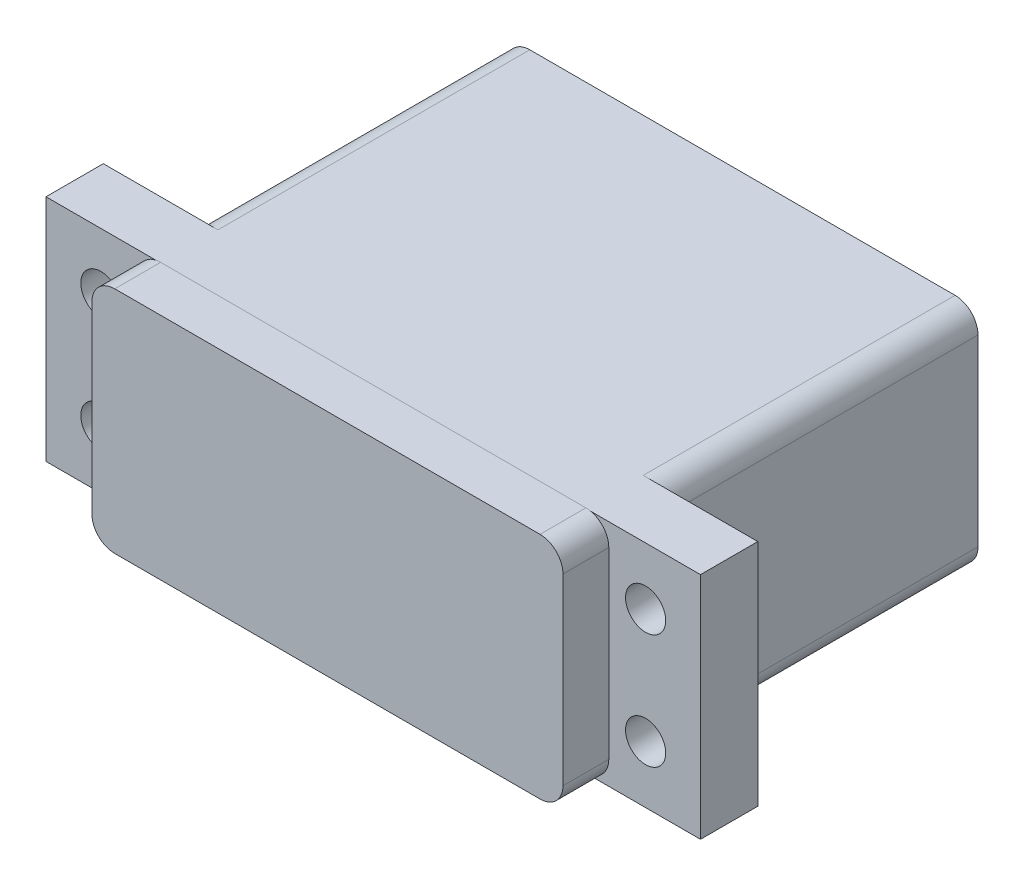
ISO-10303-21;
HEADER;
FILE_DESCRIPTION(('STEP AP214'),'2;1');
FILE_NAME('part.step','',(''),(''),'','','');
FILE_SCHEMA(('AUTOMOTIVE_DESIGN { 1 0 10303 214 1 1 1 1 }'));
ENDSEC;
DATA;
#1=APPLICATION_CONTEXT('core data for automotive mechanical design processes');
#2=APPLICATION_PROTOCOL_DEFINITION('international standard','automotive_design',2000,#1);
#3=PRODUCT_CONTEXT('',#1,'mechanical');
#4=PRODUCT('Part','Part','',(#3));
#5=PRODUCT_RELATED_PRODUCT_CATEGORY('part','',(#4));
#6=PRODUCT_DEFINITION_FORMATION('','',#4);
#7=PRODUCT_DEFINITION_CONTEXT('part definition',#1,'design');
#8=PRODUCT_DEFINITION('design','',#6,#7);
#9=PRODUCT_DEFINITION_SHAPE('','',#8);
#10=(LENGTH_UNIT() NAMED_UNIT(*) SI_UNIT(.MILLI.,.METRE.));
#11=(NAMED_UNIT(*) PLANE_ANGLE_UNIT() SI_UNIT($,.RADIAN.));
#12=(NAMED_UNIT(*) SI_UNIT($,.STERADIAN.) SOLID_ANGLE_UNIT());
#13=UNCERTAINTY_MEASURE_WITH_UNIT(LENGTH_MEASURE(1.E-05),#10,'distance_accuracy_value','');
#14=(GEOMETRIC_REPRESENTATION_CONTEXT(3) GLOBAL_UNCERTAINTY_ASSIGNED_CONTEXT((#13)) GLOBAL_UNIT_ASSIGNED_CONTEXT((#10,
#11,#12)) REPRESENTATION_CONTEXT('',''));
#15=CARTESIAN_POINT('',(0.,0.,0.));
#16=DIRECTION('',(0.,0.,1.));
#17=DIRECTION('',(1.,0.,0.));
#18=AXIS2_PLACEMENT_3D('',#15,#16,#17);
#19=CARTESIAN_POINT('',(0.,0.,32.21));
#20=DIRECTION('',(0.,0.,-1.));
#21=DIRECTION('',(-1.,0.,0.));
#22=AXIS2_PLACEMENT_3D('',#19,#20,#21);
#23=PLANE('',#22);
#24=CARTESIAN_POINT('',(52.2578901184198,-10.324573125464,32.21));
#25=DIRECTION('',(0.,0.,1.));
#26=DIRECTION('',(-1.,0.,0.));
#27=AXIS2_PLACEMENT_3D('',#24,#25,#26);
#28=CIRCLE('',#27,1.75259649145021);
#29=CARTESIAN_POINT('',(50.5052936269696,-10.324573125464,32.21));
#30=VERTEX_POINT('',#29);
#31=EDGE_CURVE('E359',#30,#30,#28,.T.);
#32=ORIENTED_EDGE('',*,*,#31,.F.);
#33=EDGE_LOOP('',(#32));
#34=FACE_BOUND('',#33,.T.);
#35=CARTESIAN_POINT('',(52.2578901184198,-20.324573125464,32.21));
#36=DIRECTION('',(0.,0.,1.));
#37=DIRECTION('',(1.,0.,0.));
#38=AXIS2_PLACEMENT_3D('',#35,#36,#37);
#39=CIRCLE('',#38,1.75259649145021);
#40=CARTESIAN_POINT('',(54.01048660987,-20.324573125464,32.21));
#41=VERTEX_POINT('',#40);
#42=EDGE_CURVE('E349',#41,#41,#39,.T.);
#43=ORIENTED_EDGE('',*,*,#42,.F.);
#44=EDGE_LOOP('',(#43));
#45=FACE_BOUND('',#44,.T.);
#46=CARTESIAN_POINT('',(4.73476021565602,-20.324573125464,32.21));
#47=DIRECTION('',(0.,0.,1.));
#48=DIRECTION('',(-1.,0.,0.));
#49=AXIS2_PLACEMENT_3D('',#46,#47,#48);
#50=CIRCLE('',#49,1.75259649145021);
#51=CARTESIAN_POINT('',(2.98216372420581,-20.324573125464,32.21));
#52=VERTEX_POINT('',#51);
#53=EDGE_CURVE('E346',#52,#52,#50,.T.);
#54=ORIENTED_EDGE('',*,*,#53,.F.);
#55=EDGE_LOOP('',(#54));
#56=FACE_BOUND('',#55,.T.);
#57=CARTESIAN_POINT('',(4.73476021565602,-10.324573125464,32.21));
#58=DIRECTION('',(0.,0.,1.));
#59=DIRECTION('',(1.,0.,0.));
#60=AXIS2_PLACEMENT_3D('',#57,#58,#59);
#61=CIRCLE('',#60,1.75259649145021);
#62=CARTESIAN_POINT('',(6.48735670710623,-10.324573125464,32.21));
#63=VERTEX_POINT('',#62);
#64=EDGE_CURVE('E343',#63,#63,#61,.T.);
#65=ORIENTED_EDGE('',*,*,#64,.F.);
#66=EDGE_LOOP('',(#65));
#67=FACE_BOUND('',#66,.T.);
#68=CARTESIAN_POINT('',(9.94632516703789,-7.27930100560158,32.21));
#69=DIRECTION('',(0.,0.,1.));
#70=DIRECTION('',(-1.,0.,0.));
#71=AXIS2_PLACEMENT_3D('',#68,#69,#70);
#72=CIRCLE('',#71,2.);
#73=CARTESIAN_POINT('',(9.52319526427415,-5.324573125464,32.21));
#74=VERTEX_POINT('',#73);
#75=CARTESIAN_POINT('',(7.94632516703789,-7.27930100560158,32.21));
#76=VERTEX_POINT('',#75);
#77=EDGE_CURVE('E11',#74,#76,#72,.T.);
#78=ORIENTED_EDGE('',*,*,#77,.F.);
#79=DIRECTION('',(-1.,0.,0.));
#80=VECTOR('',#79,1.);
#81=CARTESIAN_POINT('',(-0.0536748329621126,-5.324573125464,32.21));
#82=LINE('',#81,#80);
#83=CARTESIAN_POINT('',(-0.0536748329621126,-5.324573125464,32.21));
#84=VERTEX_POINT('',#83);
#85=EDGE_CURVE('E215',#74,#84,#82,.T.);
#86=ORIENTED_EDGE('',*,*,#85,.T.);
#87=DIRECTION('',(0.,-1.,0.));
#88=VECTOR('',#87,1.);
#89=CARTESIAN_POINT('',(-0.0536748329621126,-5.324573125464,32.21));
#90=LINE('',#89,#88);
#91=CARTESIAN_POINT('',(-0.0536748329621126,-25.324573125464,32.21));
#92=VERTEX_POINT('',#91);
#93=EDGE_CURVE('E219',#84,#92,#90,.T.);
#94=ORIENTED_EDGE('',*,*,#93,.T.);
#95=DIRECTION('',(1.,0.,0.));
#96=VECTOR('',#95,1.);
#97=CARTESIAN_POINT('',(-0.0536748329621126,-25.324573125464,32.21));
#98=LINE('',#97,#96);
#99=CARTESIAN_POINT('',(57.0463251670379,-25.324573125464,32.21));
#100=VERTEX_POINT('',#99);
#101=EDGE_CURVE('E209',#92,#100,#98,.T.);
#102=ORIENTED_EDGE('',*,*,#101,.T.);
#103=DIRECTION('',(0.,1.,0.));
#104=VECTOR('',#103,1.);
#105=CARTESIAN_POINT('',(57.0463251670379,-5.324573125464,32.21));
#106=LINE('',#105,#104);
#107=CARTESIAN_POINT('',(57.0463251670379,-5.324573125464,32.21));
#108=VERTEX_POINT('',#107);
#109=EDGE_CURVE('E212',#100,#108,#106,.T.);
#110=ORIENTED_EDGE('',*,*,#109,.T.);
#111=CARTESIAN_POINT('',(47.4694550698016,-5.324573125464,32.21));
#112=VERTEX_POINT('',#111);
#113=EDGE_CURVE('E216',#108,#112,#82,.T.);
#114=ORIENTED_EDGE('',*,*,#113,.T.);
#115=CARTESIAN_POINT('',(47.0463251670379,-7.27930100560158,32.21));
#116=DIRECTION('',(0.,0.,1.));
#117=DIRECTION('',(-1.,0.,0.));
#118=AXIS2_PLACEMENT_3D('',#115,#116,#117);
#119=CIRCLE('',#118,2.);
#120=CARTESIAN_POINT('',(49.0463251670379,-7.27930100560158,32.21));
#121=VERTEX_POINT('',#120);
#122=EDGE_CURVE('E379',#121,#112,#119,.T.);
#123=ORIENTED_EDGE('',*,*,#122,.F.);
#124=DIRECTION('',(0.,1.,0.));
#125=VECTOR('',#124,1.);
#126=CARTESIAN_POINT('',(49.0463251670379,-7.27930100560158,32.21));
#127=LINE('',#126,#125);
#128=CARTESIAN_POINT('',(49.0463251670379,-23.2793010056016,32.21));
#129=VERTEX_POINT('',#128);
#130=EDGE_CURVE('E376',#129,#121,#127,.T.);
#131=ORIENTED_EDGE('',*,*,#130,.F.);
#132=CARTESIAN_POINT('',(47.0463251670379,-23.2793010056016,32.21));
#133=DIRECTION('',(0.,0.,1.));
#134=DIRECTION('',(1.,0.,0.));
#135=AXIS2_PLACEMENT_3D('',#132,#133,#134);
#136=CIRCLE('',#135,2.);
#137=CARTESIAN_POINT('',(47.0463251670379,-25.2793010056016,32.21));
#138=VERTEX_POINT('',#137);
#139=EDGE_CURVE('E200',#138,#129,#136,.T.);
#140=ORIENTED_EDGE('',*,*,#139,.F.);
#141=DIRECTION('',(1.,0.,0.));
#142=VECTOR('',#141,1.);
#143=CARTESIAN_POINT('',(9.94632516703789,-25.2793010056016,32.21));
#144=LINE('',#143,#142);
#145=CARTESIAN_POINT('',(9.94632516703789,-25.2793010056016,32.21));
#146=VERTEX_POINT('',#145);
#147=EDGE_CURVE('E197',#146,#138,#144,.T.);
#148=ORIENTED_EDGE('',*,*,#147,.F.);
#149=CARTESIAN_POINT('',(9.94632516703789,-23.2793010056016,32.21));
#150=DIRECTION('',(0.,0.,1.));
#151=DIRECTION('',(1.,0.,0.));
#152=AXIS2_PLACEMENT_3D('',#149,#150,#151);
#153=CIRCLE('',#152,2.);
#154=CARTESIAN_POINT('',(7.94632516703789,-23.2793010056016,32.21));
#155=VERTEX_POINT('',#154);
#156=EDGE_CURVE('E55',#155,#146,#153,.T.);
#157=ORIENTED_EDGE('',*,*,#156,.F.);
#158=DIRECTION('',(0.,-1.,0.));
#159=VECTOR('',#158,1.);
#160=CARTESIAN_POINT('',(7.94632516703789,-7.27930100560158,32.21));
#161=LINE('',#160,#159);
#162=EDGE_CURVE('E51',#76,#155,#161,.T.);
#163=ORIENTED_EDGE('',*,*,#162,.F.);
#164=EDGE_LOOP('',(#78,#86,#94,#102,#110,#114,#123,#131,#140,#148,#157,#163));
#165=FACE_BOUND('',#164,.T.);
#166=ADVANCED_FACE('F33',(#34,#45,#56,#67,#165),#23,.F.);
#167=CARTESIAN_POINT('',(47.0463251670379,-23.324573125464,27.21));
#168=DIRECTION('',(0.,0.,-1.));
#169=DIRECTION('',(-1.,0.,0.));
#170=AXIS2_PLACEMENT_3D('',#167,#168,#169);
#171=CYLINDRICAL_SURFACE('',#170,2.);
#172=CARTESIAN_POINT('',(47.0463251670379,-23.324573125464,0.));
#173=DIRECTION('',(0.,0.,1.));
#174=DIRECTION('',(1.,0.,0.));
#175=AXIS2_PLACEMENT_3D('',#172,#173,#174);
#176=CIRCLE('',#175,2.);
#177=CARTESIAN_POINT('',(47.0463251670379,-25.324573125464,0.));
#178=VERTEX_POINT('',#177);
#179=CARTESIAN_POINT('',(49.0463251670379,-23.324573125464,0.));
#180=VERTEX_POINT('',#179);
#181=EDGE_CURVE('E235',#178,#180,#176,.T.);
#182=ORIENTED_EDGE('',*,*,#181,.T.);
#183=DIRECTION('',(0.,0.,-1.));
#184=VECTOR('',#183,1.);
#185=CARTESIAN_POINT('',(49.0463251670379,-23.324573125464,27.21));
#186=LINE('',#185,#184);
#187=CARTESIAN_POINT('',(49.0463251670379,-23.324573125464,27.21));
#188=VERTEX_POINT('',#187);
#189=EDGE_CURVE('E42',#188,#180,#186,.T.);
#190=ORIENTED_EDGE('',*,*,#189,.F.);
#191=CARTESIAN_POINT('',(47.0463251670379,-23.324573125464,27.21));
#192=DIRECTION('',(0.,0.,1.));
#193=DIRECTION('',(1.,0.,0.));
#194=AXIS2_PLACEMENT_3D('',#191,#192,#193);
#195=CIRCLE('',#194,2.);
#196=CARTESIAN_POINT('',(47.0463251670379,-25.324573125464,27.21));
#197=VERTEX_POINT('',#196);
#198=EDGE_CURVE('E279',#197,#188,#195,.T.);
#199=ORIENTED_EDGE('',*,*,#198,.F.);
#200=DIRECTION('',(0.,0.,-1.));
#201=VECTOR('',#200,1.);
#202=CARTESIAN_POINT('',(47.0463251670379,-25.324573125464,27.21));
#203=LINE('',#202,#201);
#204=EDGE_CURVE('E298',#197,#178,#203,.T.);
#205=ORIENTED_EDGE('',*,*,#204,.T.);
#206=EDGE_LOOP('',(#182,#190,#199,#205));
#207=FACE_BOUND('',#206,.T.);
#208=ADVANCED_FACE('F35',(#207),#171,.T.);
#209=CARTESIAN_POINT('',(49.0463251670379,-7.32457312546402,27.21));
#210=DIRECTION('',(-1.,0.,0.));
#211=DIRECTION('',(0.,-1.,0.));
#212=AXIS2_PLACEMENT_3D('',#209,#210,#211);
#213=PLANE('',#212);
#214=DIRECTION('',(0.,1.,0.));
#215=VECTOR('',#214,1.);
#216=CARTESIAN_POINT('',(49.0463251670379,-7.32457312546402,0.));
#217=LINE('',#216,#215);
#218=CARTESIAN_POINT('',(49.0463251670379,-7.32457312546402,0.));
#219=VERTEX_POINT('',#218);
#220=EDGE_CURVE('E428',#180,#219,#217,.T.);
#221=ORIENTED_EDGE('',*,*,#220,.T.);
#222=DIRECTION('',(0.,0.,-1.));
#223=VECTOR('',#222,1.);
#224=CARTESIAN_POINT('',(49.0463251670379,-7.32457312546402,27.21));
#225=LINE('',#224,#223);
#226=CARTESIAN_POINT('',(49.0463251670379,-7.32457312546402,27.21));
#227=VERTEX_POINT('',#226);
#228=EDGE_CURVE('E309',#227,#219,#225,.T.);
#229=ORIENTED_EDGE('',*,*,#228,.F.);
#230=DIRECTION('',(0.,1.,0.));
#231=VECTOR('',#230,1.);
#232=CARTESIAN_POINT('',(49.0463251670379,-7.32457312546402,27.21));
#233=LINE('',#232,#231);
#234=EDGE_CURVE('E271',#188,#227,#233,.T.);
#235=ORIENTED_EDGE('',*,*,#234,.F.);
#236=ORIENTED_EDGE('',*,*,#189,.T.);
#237=EDGE_LOOP('',(#221,#229,#235,#236));
#238=FACE_BOUND('',#237,.T.);
#239=ADVANCED_FACE('F427',(#238),#213,.F.);
#240=CARTESIAN_POINT('',(47.0463251670379,-7.324573125464,27.21));
#241=DIRECTION('',(0.,0.,-1.));
#242=DIRECTION('',(-1.,0.,0.));
#243=AXIS2_PLACEMENT_3D('',#240,#241,#242);
#244=CYLINDRICAL_SURFACE('',#243,2.);
#245=CARTESIAN_POINT('',(47.0463251670379,-7.324573125464,0.));
#246=DIRECTION('',(0.,0.,1.));
#247=DIRECTION('',(-1.,0.,0.));
#248=AXIS2_PLACEMENT_3D('',#245,#246,#247);
#249=CIRCLE('',#248,2.);
#250=CARTESIAN_POINT('',(47.0463251670379,-5.324573125464,0.));
#251=VERTEX_POINT('',#250);
#252=EDGE_CURVE('E431',#219,#251,#249,.T.);
#253=ORIENTED_EDGE('',*,*,#252,.T.);
#254=DIRECTION('',(0.,0.,-1.));
#255=VECTOR('',#254,1.);
#256=CARTESIAN_POINT('',(47.0463251670379,-5.324573125464,27.21));
#257=LINE('',#256,#255);
#258=CARTESIAN_POINT('',(47.0463251670379,-5.324573125464,27.21));
#259=VERTEX_POINT('',#258);
#260=EDGE_CURVE('E284',#259,#251,#257,.T.);
#261=ORIENTED_EDGE('',*,*,#260,.F.);
#262=CARTESIAN_POINT('',(47.0463251670379,-7.324573125464,27.21));
#263=DIRECTION('',(0.,0.,1.));
#264=DIRECTION('',(-1.,0.,0.));
#265=AXIS2_PLACEMENT_3D('',#262,#263,#264);
#266=CIRCLE('',#265,2.);
#267=EDGE_CURVE('E269',#227,#259,#266,.T.);
#268=ORIENTED_EDGE('',*,*,#267,.F.);
#269=ORIENTED_EDGE('',*,*,#228,.T.);
#270=EDGE_LOOP('',(#253,#261,#268,#269));
#271=FACE_BOUND('',#270,.T.);
#272=ADVANCED_FACE('F430',(#271),#244,.T.);
#273=CARTESIAN_POINT('',(9.9463251670379,-5.324573125464,27.21));
#274=DIRECTION('',(0.,-1.,0.));
#275=DIRECTION('',(0.,0.,-1.));
#276=AXIS2_PLACEMENT_3D('',#273,#274,#275);
#277=PLANE('',#276);
#278=DIRECTION('',(-1.,0.,0.));
#279=VECTOR('',#278,1.);
#280=CARTESIAN_POINT('',(9.9463251670379,-5.324573125464,0.));
#281=LINE('',#280,#279);
#282=CARTESIAN_POINT('',(9.9463251670379,-5.324573125464,0.));
#283=VERTEX_POINT('',#282);
#284=EDGE_CURVE('E435',#251,#283,#281,.T.);
#285=ORIENTED_EDGE('',*,*,#284,.T.);
#286=DIRECTION('',(0.,0.,-1.));
#287=VECTOR('',#286,1.);
#288=CARTESIAN_POINT('',(9.9463251670379,-5.324573125464,27.21));
#289=LINE('',#288,#287);
#290=CARTESIAN_POINT('',(9.9463251670379,-5.324573125464,27.21));
#291=VERTEX_POINT('',#290);
#292=EDGE_CURVE('E301',#291,#283,#289,.T.);
#293=ORIENTED_EDGE('',*,*,#292,.F.);
#294=DIRECTION('',(-1.,0.,0.));
#295=VECTOR('',#294,1.);
#296=CARTESIAN_POINT('',(-0.0536748329621126,-5.324573125464,27.21));
#297=LINE('',#296,#295);
#298=CARTESIAN_POINT('',(-0.0536748329621126,-5.324573125464,27.21));
#299=VERTEX_POINT('',#298);
#300=EDGE_CURVE('E248',#291,#299,#297,.T.);
#301=ORIENTED_EDGE('',*,*,#300,.T.);
#302=DIRECTION('',(0.,0.,-1.));
#303=VECTOR('',#302,1.);
#304=CARTESIAN_POINT('',(-0.0536748329621126,-5.324573125464,32.21));
#305=LINE('',#304,#303);
#306=EDGE_CURVE('E239',#84,#299,#305,.T.);
#307=ORIENTED_EDGE('',*,*,#306,.F.);
#308=ORIENTED_EDGE('',*,*,#85,.F.);
#309=EDGE_CURVE('E220',#112,#74,#82,.T.);
#310=ORIENTED_EDGE('',*,*,#309,.F.);
#311=ORIENTED_EDGE('',*,*,#113,.F.);
#312=DIRECTION('',(0.,0.,-1.));
#313=VECTOR('',#312,1.);
#314=CARTESIAN_POINT('',(57.0463251670379,-5.324573125464,32.21));
#315=LINE('',#314,#313);
#316=CARTESIAN_POINT('',(57.0463251670379,-5.324573125464,27.21));
#317=VERTEX_POINT('',#316);
#318=EDGE_CURVE('E236',#108,#317,#315,.T.);
#319=ORIENTED_EDGE('',*,*,#318,.T.);
#320=EDGE_CURVE('E244',#317,#259,#297,.T.);
#321=ORIENTED_EDGE('',*,*,#320,.T.);
#322=ORIENTED_EDGE('',*,*,#260,.T.);
#323=EDGE_LOOP('',(#285,#293,#301,#307,#308,#310,#311,#319,#321,#322));
#324=FACE_BOUND('',#323,.T.);
#325=ADVANCED_FACE('F264',(#324),#277,.F.);
#326=CARTESIAN_POINT('',(9.94632516703789,-7.324573125464,27.21));
#327=DIRECTION('',(0.,0.,-1.));
#328=DIRECTION('',(-1.,0.,0.));
#329=AXIS2_PLACEMENT_3D('',#326,#327,#328);
#330=CYLINDRICAL_SURFACE('',#329,2.);
#331=CARTESIAN_POINT('',(9.94632516703789,-7.324573125464,0.));
#332=DIRECTION('',(0.,0.,1.));
#333=DIRECTION('',(-1.,0.,0.));
#334=AXIS2_PLACEMENT_3D('',#331,#332,#333);
#335=CIRCLE('',#334,2.);
#336=CARTESIAN_POINT('',(7.94632516703789,-7.32457312546402,0.));
#337=VERTEX_POINT('',#336);
#338=EDGE_CURVE('E437',#283,#337,#335,.T.);
#339=ORIENTED_EDGE('',*,*,#338,.T.);
#340=DIRECTION('',(0.,0.,-1.));
#341=VECTOR('',#340,1.);
#342=CARTESIAN_POINT('',(7.94632516703789,-7.32457312546402,27.21));
#343=LINE('',#342,#341);
#344=CARTESIAN_POINT('',(7.94632516703789,-7.32457312546402,27.21));
#345=VERTEX_POINT('',#344);
#346=EDGE_CURVE('E304',#345,#337,#343,.T.);
#347=ORIENTED_EDGE('',*,*,#346,.F.);
#348=CARTESIAN_POINT('',(9.94632516703789,-7.324573125464,27.21));
#349=DIRECTION('',(0.,0.,1.));
#350=DIRECTION('',(-1.,0.,0.));
#351=AXIS2_PLACEMENT_3D('',#348,#349,#350);
#352=CIRCLE('',#351,2.);
#353=EDGE_CURVE('E274',#291,#345,#352,.T.);
#354=ORIENTED_EDGE('',*,*,#353,.F.);
#355=ORIENTED_EDGE('',*,*,#292,.T.);
#356=EDGE_LOOP('',(#339,#347,#354,#355));
#357=FACE_BOUND('',#356,.T.);
#358=ADVANCED_FACE('F452',(#357),#330,.T.);
#359=CARTESIAN_POINT('',(7.94632516703789,-7.32457312546402,27.21));
#360=DIRECTION('',(1.,0.,0.));
#361=DIRECTION('',(0.,0.,-1.));
#362=AXIS2_PLACEMENT_3D('',#359,#360,#361);
#363=PLANE('',#362);
#364=DIRECTION('',(0.,-1.,0.));
#365=VECTOR('',#364,1.);
#366=CARTESIAN_POINT('',(7.94632516703789,-7.32457312546402,0.));
#367=LINE('',#366,#365);
#368=CARTESIAN_POINT('',(7.94632516703789,-23.324573125464,0.));
#369=VERTEX_POINT('',#368);
#370=EDGE_CURVE('E441',#337,#369,#367,.T.);
#371=ORIENTED_EDGE('',*,*,#370,.T.);
#372=DIRECTION('',(0.,0.,-1.));
#373=VECTOR('',#372,1.);
#374=CARTESIAN_POINT('',(7.94632516703789,-23.324573125464,27.21));
#375=LINE('',#374,#373);
#376=CARTESIAN_POINT('',(7.94632516703789,-23.324573125464,27.21));
#377=VERTEX_POINT('',#376);
#378=EDGE_CURVE('E311',#377,#369,#375,.T.);
#379=ORIENTED_EDGE('',*,*,#378,.F.);
#380=DIRECTION('',(0.,-1.,0.));
#381=VECTOR('',#380,1.);
#382=CARTESIAN_POINT('',(7.94632516703789,-7.32457312546402,27.21));
#383=LINE('',#382,#381);
#384=EDGE_CURVE('E277',#345,#377,#383,.T.);
#385=ORIENTED_EDGE('',*,*,#384,.F.);
#386=ORIENTED_EDGE('',*,*,#346,.T.);
#387=EDGE_LOOP('',(#371,#379,#385,#386));
#388=FACE_BOUND('',#387,.T.);
#389=ADVANCED_FACE('F448',(#388),#363,.F.);
#390=CARTESIAN_POINT('',(9.94632516703789,-23.324573125464,27.21));
#391=DIRECTION('',(0.,0.,-1.));
#392=DIRECTION('',(-1.,0.,0.));
#393=AXIS2_PLACEMENT_3D('',#390,#391,#392);
#394=CYLINDRICAL_SURFACE('',#393,2.);
#395=CARTESIAN_POINT('',(9.94632516703789,-23.324573125464,0.));
#396=DIRECTION('',(0.,0.,1.));
#397=DIRECTION('',(1.,0.,0.));
#398=AXIS2_PLACEMENT_3D('',#395,#396,#397);
#399=CIRCLE('',#398,2.);
#400=CARTESIAN_POINT('',(9.9463251670379,-25.324573125464,0.));
#401=VERTEX_POINT('',#400);
#402=EDGE_CURVE('E443',#369,#401,#399,.T.);
#403=ORIENTED_EDGE('',*,*,#402,.T.);
#404=DIRECTION('',(0.,0.,-1.));
#405=VECTOR('',#404,1.);
#406=CARTESIAN_POINT('',(9.9463251670379,-25.324573125464,27.21));
#407=LINE('',#406,#405);
#408=CARTESIAN_POINT('',(9.94632516703789,-25.324573125464,27.21));
#409=VERTEX_POINT('',#408);
#410=EDGE_CURVE('E317',#409,#401,#407,.T.);
#411=ORIENTED_EDGE('',*,*,#410,.F.);
#412=CARTESIAN_POINT('',(9.94632516703789,-23.324573125464,27.21));
#413=DIRECTION('',(0.,0.,1.));
#414=DIRECTION('',(1.,0.,0.));
#415=AXIS2_PLACEMENT_3D('',#412,#413,#414);
#416=CIRCLE('',#415,2.);
#417=EDGE_CURVE('E290',#377,#409,#416,.T.);
#418=ORIENTED_EDGE('',*,*,#417,.F.);
#419=ORIENTED_EDGE('',*,*,#378,.T.);
#420=EDGE_LOOP('',(#403,#411,#418,#419));
#421=FACE_BOUND('',#420,.T.);
#422=ADVANCED_FACE('F446',(#421),#394,.T.);
#423=CARTESIAN_POINT('',(9.9463251670379,-25.324573125464,27.21));
#424=DIRECTION('',(0.,1.,0.));
#425=DIRECTION('',(0.,0.,1.));
#426=AXIS2_PLACEMENT_3D('',#423,#424,#425);
#427=PLANE('',#426);
#428=DIRECTION('',(1.,0.,0.));
#429=VECTOR('',#428,1.);
#430=CARTESIAN_POINT('',(9.9463251670379,-25.324573125464,0.));
#431=LINE('',#430,#429);
#432=EDGE_CURVE('E337',#401,#178,#431,.T.);
#433=ORIENTED_EDGE('',*,*,#432,.T.);
#434=ORIENTED_EDGE('',*,*,#204,.F.);
#435=DIRECTION('',(1.,0.,0.));
#436=VECTOR('',#435,1.);
#437=CARTESIAN_POINT('',(-0.0536748329621126,-25.324573125464,27.21));
#438=LINE('',#437,#436);
#439=CARTESIAN_POINT('',(57.0463251670379,-25.324573125464,27.21));
#440=VERTEX_POINT('',#439);
#441=EDGE_CURVE('E201',#197,#440,#438,.T.);
#442=ORIENTED_EDGE('',*,*,#441,.T.);
#443=DIRECTION('',(0.,0.,-1.));
#444=VECTOR('',#443,1.);
#445=CARTESIAN_POINT('',(57.0463251670379,-25.324573125464,32.21));
#446=LINE('',#445,#444);
#447=EDGE_CURVE('E232',#100,#440,#446,.T.);
#448=ORIENTED_EDGE('',*,*,#447,.F.);
#449=ORIENTED_EDGE('',*,*,#101,.F.);
#450=DIRECTION('',(0.,0.,-1.));
#451=VECTOR('',#450,1.);
#452=CARTESIAN_POINT('',(-0.0536748329621126,-25.324573125464,32.21));
#453=LINE('',#452,#451);
#454=CARTESIAN_POINT('',(-0.0536748329621126,-25.324573125464,27.21));
#455=VERTEX_POINT('',#454);
#456=EDGE_CURVE('E222',#92,#455,#453,.T.);
#457=ORIENTED_EDGE('',*,*,#456,.T.);
#458=EDGE_CURVE('E203',#455,#409,#438,.T.);
#459=ORIENTED_EDGE('',*,*,#458,.T.);
#460=ORIENTED_EDGE('',*,*,#410,.T.);
#461=EDGE_LOOP('',(#433,#434,#442,#448,#449,#457,#459,#460));
#462=FACE_BOUND('',#461,.T.);
#463=ADVANCED_FACE('F424',(#462),#427,.F.);
#464=CARTESIAN_POINT('',(47.0463251670379,-23.324573125464,0.));
#465=DIRECTION('',(0.,0.,1.));
#466=DIRECTION('',(1.,0.,0.));
#467=AXIS2_PLACEMENT_3D('',#464,#465,#466);
#468=PLANE('',#467);
#469=ORIENTED_EDGE('',*,*,#181,.F.);
#470=ORIENTED_EDGE('',*,*,#432,.F.);
#471=ORIENTED_EDGE('',*,*,#402,.F.);
#472=ORIENTED_EDGE('',*,*,#370,.F.);
#473=ORIENTED_EDGE('',*,*,#338,.F.);
#474=ORIENTED_EDGE('',*,*,#284,.F.);
#475=ORIENTED_EDGE('',*,*,#252,.F.);
#476=ORIENTED_EDGE('',*,*,#220,.F.);
#477=EDGE_LOOP('',(#469,#470,#471,#472,#473,#474,#475,#476));
#478=FACE_BOUND('',#477,.T.);
#479=ADVANCED_FACE('F434',(#478),#468,.F.);
#480=CARTESIAN_POINT('',(0.,0.,27.21));
#481=DIRECTION('',(0.,0.,-1.));
#482=DIRECTION('',(-1.,0.,0.));
#483=AXIS2_PLACEMENT_3D('',#480,#481,#482);
#484=PLANE('',#483);
#485=CARTESIAN_POINT('',(52.2578901184198,-10.324573125464,27.21));
#486=DIRECTION('',(0.,0.,-1.));
#487=DIRECTION('',(-1.,0.,0.));
#488=AXIS2_PLACEMENT_3D('',#485,#486,#487);
#489=CIRCLE('',#488,1.75259649145021);
#490=CARTESIAN_POINT('',(50.5052936269696,-10.324573125464,27.21));
#491=VERTEX_POINT('',#490);
#492=EDGE_CURVE('E37',#491,#491,#489,.T.);
#493=ORIENTED_EDGE('',*,*,#492,.F.);
#494=EDGE_LOOP('',(#493));
#495=FACE_BOUND('',#494,.T.);
#496=CARTESIAN_POINT('',(52.2578901184198,-20.324573125464,27.21));
#497=DIRECTION('',(0.,0.,-1.));
#498=DIRECTION('',(-1.,0.,0.));
#499=AXIS2_PLACEMENT_3D('',#496,#497,#498);
#500=CIRCLE('',#499,1.75259649145021);
#501=CARTESIAN_POINT('',(50.5052936269696,-20.324573125464,27.21));
#502=VERTEX_POINT('',#501);
#503=EDGE_CURVE('E347',#502,#502,#500,.T.);
#504=ORIENTED_EDGE('',*,*,#503,.F.);
#505=EDGE_LOOP('',(#504));
#506=FACE_BOUND('',#505,.T.);
#507=ORIENTED_EDGE('',*,*,#441,.F.);
#508=ORIENTED_EDGE('',*,*,#198,.T.);
#509=ORIENTED_EDGE('',*,*,#234,.T.);
#510=ORIENTED_EDGE('',*,*,#267,.T.);
#511=ORIENTED_EDGE('',*,*,#320,.F.);
#512=DIRECTION('',(0.,1.,0.));
#513=VECTOR('',#512,1.);
#514=CARTESIAN_POINT('',(57.0463251670379,-5.324573125464,27.21));
#515=LINE('',#514,#513);
#516=EDGE_CURVE('E225',#440,#317,#515,.T.);
#517=ORIENTED_EDGE('',*,*,#516,.F.);
#518=EDGE_LOOP('',(#507,#508,#509,#510,#511,#517));
#519=FACE_BOUND('',#518,.T.);
#520=ADVANCED_FACE('F266',(#495,#506,#519),#484,.T.);
#521=CARTESIAN_POINT('',(57.0463251670379,-5.324573125464,32.21));
#522=DIRECTION('',(-1.,0.,0.));
#523=DIRECTION('',(0.,-1.,0.));
#524=AXIS2_PLACEMENT_3D('',#521,#522,#523);
#525=PLANE('',#524);
#526=ORIENTED_EDGE('',*,*,#516,.T.);
#527=ORIENTED_EDGE('',*,*,#318,.F.);
#528=ORIENTED_EDGE('',*,*,#109,.F.);
#529=ORIENTED_EDGE('',*,*,#447,.T.);
#530=EDGE_LOOP('',(#526,#527,#528,#529));
#531=FACE_BOUND('',#530,.T.);
#532=ADVANCED_FACE('F259',(#531),#525,.F.);
#533=CARTESIAN_POINT('',(-0.0536748329621126,-5.324573125464,32.21));
#534=DIRECTION('',(1.,0.,0.));
#535=DIRECTION('',(0.,0.,-1.));
#536=AXIS2_PLACEMENT_3D('',#533,#534,#535);
#537=PLANE('',#536);
#538=DIRECTION('',(0.,-1.,0.));
#539=VECTOR('',#538,1.);
#540=CARTESIAN_POINT('',(-0.0536748329621126,-5.324573125464,27.21));
#541=LINE('',#540,#539);
#542=EDGE_CURVE('E213',#299,#455,#541,.T.);
#543=ORIENTED_EDGE('',*,*,#542,.T.);
#544=ORIENTED_EDGE('',*,*,#456,.F.);
#545=ORIENTED_EDGE('',*,*,#93,.F.);
#546=ORIENTED_EDGE('',*,*,#306,.T.);
#547=EDGE_LOOP('',(#543,#544,#545,#546));
#548=FACE_BOUND('',#547,.T.);
#549=ADVANCED_FACE('F474',(#548),#537,.F.);
#550=CARTESIAN_POINT('',(4.73476021565602,-20.324573125464,27.21));
#551=DIRECTION('',(0.,0.,-1.));
#552=DIRECTION('',(-1.,0.,0.));
#553=AXIS2_PLACEMENT_3D('',#550,#551,#552);
#554=CIRCLE('',#553,1.75259649145021);
#555=CARTESIAN_POINT('',(2.98216372420581,-20.324573125464,27.21));
#556=VERTEX_POINT('',#555);
#557=EDGE_CURVE('E344',#556,#556,#554,.T.);
#558=ORIENTED_EDGE('',*,*,#557,.F.);
#559=EDGE_LOOP('',(#558));
#560=FACE_BOUND('',#559,.T.);
#561=CARTESIAN_POINT('',(4.73476021565602,-10.324573125464,27.21));
#562=DIRECTION('',(0.,0.,-1.));
#563=DIRECTION('',(-1.,0.,0.));
#564=AXIS2_PLACEMENT_3D('',#561,#562,#563);
#565=CIRCLE('',#564,1.75259649145021);
#566=CARTESIAN_POINT('',(2.98216372420581,-10.324573125464,27.21));
#567=VERTEX_POINT('',#566);
#568=EDGE_CURVE('E340',#567,#567,#565,.T.);
#569=ORIENTED_EDGE('',*,*,#568,.F.);
#570=EDGE_LOOP('',(#569));
#571=FACE_BOUND('',#570,.T.);
#572=ORIENTED_EDGE('',*,*,#300,.F.);
#573=ORIENTED_EDGE('',*,*,#353,.T.);
#574=ORIENTED_EDGE('',*,*,#384,.T.);
#575=ORIENTED_EDGE('',*,*,#417,.T.);
#576=ORIENTED_EDGE('',*,*,#458,.F.);
#577=ORIENTED_EDGE('',*,*,#542,.F.);
#578=EDGE_LOOP('',(#572,#573,#574,#575,#576,#577));
#579=FACE_BOUND('',#578,.T.);
#580=ADVANCED_FACE('F450',(#560,#571,#579),#484,.T.);
#581=CARTESIAN_POINT('',(47.0463251670379,-23.2793010056016,32.21));
#582=DIRECTION('',(0.,0.,1.));
#583=DIRECTION('',(1.,0.,0.));
#584=AXIS2_PLACEMENT_3D('',#581,#582,#583);
#585=PLANE('',#584);
#586=CARTESIAN_POINT('',(47.0463251670379,-5.27930100560158,32.21));
#587=VERTEX_POINT('',#586);
#588=EDGE_CURVE('E378',#112,#587,#119,.T.);
#589=ORIENTED_EDGE('',*,*,#588,.F.);
#590=ORIENTED_EDGE('',*,*,#309,.T.);
#591=CARTESIAN_POINT('',(9.94632516703789,-5.27930100560158,32.21));
#592=VERTEX_POINT('',#591);
#593=EDGE_CURVE('E44',#592,#74,#72,.T.);
#594=ORIENTED_EDGE('',*,*,#593,.F.);
#595=DIRECTION('',(-1.,0.,0.));
#596=VECTOR('',#595,1.);
#597=CARTESIAN_POINT('',(9.94632516703789,-5.27930100560158,32.21));
#598=LINE('',#597,#596);
#599=EDGE_CURVE('E382',#587,#592,#598,.T.);
#600=ORIENTED_EDGE('',*,*,#599,.F.);
#601=EDGE_LOOP('',(#589,#590,#594,#600));
#602=FACE_BOUND('',#601,.T.);
#603=ADVANCED_FACE('F412',(#602),#585,.F.);
#604=CARTESIAN_POINT('',(47.0463251670379,-23.2793010056016,36.21));
#605=DIRECTION('',(0.,0.,-1.));
#606=DIRECTION('',(-1.,0.,0.));
#607=AXIS2_PLACEMENT_3D('',#604,#605,#606);
#608=CYLINDRICAL_SURFACE('',#607,2.);
#609=ORIENTED_EDGE('',*,*,#139,.T.);
#610=DIRECTION('',(0.,0.,-1.));
#611=VECTOR('',#610,1.);
#612=CARTESIAN_POINT('',(49.0463251670379,-23.2793010056016,36.21));
#613=LINE('',#612,#611);
#614=CARTESIAN_POINT('',(49.0463251670379,-23.2793010056016,36.21));
#615=VERTEX_POINT('',#614);
#616=EDGE_CURVE('E181',#615,#129,#613,.T.);
#617=ORIENTED_EDGE('',*,*,#616,.F.);
#618=CARTESIAN_POINT('',(47.0463251670379,-23.2793010056016,36.21));
#619=DIRECTION('',(0.,0.,1.));
#620=DIRECTION('',(1.,0.,0.));
#621=AXIS2_PLACEMENT_3D('',#618,#619,#620);
#622=CIRCLE('',#621,2.);
#623=CARTESIAN_POINT('',(47.0463251670379,-25.2793010056016,36.21));
#624=VERTEX_POINT('',#623);
#625=EDGE_CURVE('E188',#624,#615,#622,.T.);
#626=ORIENTED_EDGE('',*,*,#625,.F.);
#627=DIRECTION('',(0.,0.,-1.));
#628=VECTOR('',#627,1.);
#629=CARTESIAN_POINT('',(47.0463251670379,-25.2793010056016,36.21));
#630=LINE('',#629,#628);
#631=EDGE_CURVE('E374',#624,#138,#630,.T.);
#632=ORIENTED_EDGE('',*,*,#631,.T.);
#633=EDGE_LOOP('',(#609,#617,#626,#632));
#634=FACE_BOUND('',#633,.T.);
#635=ADVANCED_FACE('F199',(#634),#608,.T.);
#636=CARTESIAN_POINT('',(49.0463251670379,-7.27930100560158,36.21));
#637=DIRECTION('',(-1.,0.,0.));
#638=DIRECTION('',(0.,0.,1.));
#639=AXIS2_PLACEMENT_3D('',#636,#637,#638);
#640=PLANE('',#639);
#641=ORIENTED_EDGE('',*,*,#130,.T.);
#642=DIRECTION('',(0.,0.,-1.));
#643=VECTOR('',#642,1.);
#644=CARTESIAN_POINT('',(49.0463251670379,-7.27930100560158,36.21));
#645=LINE('',#644,#643);
#646=CARTESIAN_POINT('',(49.0463251670379,-7.27930100560158,36.21));
#647=VERTEX_POINT('',#646);
#648=EDGE_CURVE('E184',#647,#121,#645,.T.);
#649=ORIENTED_EDGE('',*,*,#648,.F.);
#650=DIRECTION('',(0.,1.,0.));
#651=VECTOR('',#650,1.);
#652=CARTESIAN_POINT('',(49.0463251670379,-7.27930100560158,36.21));
#653=LINE('',#652,#651);
#654=EDGE_CURVE('E176',#615,#647,#653,.T.);
#655=ORIENTED_EDGE('',*,*,#654,.F.);
#656=ORIENTED_EDGE('',*,*,#616,.T.);
#657=EDGE_LOOP('',(#641,#649,#655,#656));
#658=FACE_BOUND('',#657,.T.);
#659=ADVANCED_FACE('F179',(#658),#640,.F.);
#660=CARTESIAN_POINT('',(47.0463251670379,-7.27930100560158,36.21));
#661=DIRECTION('',(0.,0.,-1.));
#662=DIRECTION('',(-1.,0.,0.));
#663=AXIS2_PLACEMENT_3D('',#660,#661,#662);
#664=CYLINDRICAL_SURFACE('',#663,2.);
#665=ORIENTED_EDGE('',*,*,#122,.T.);
#666=ORIENTED_EDGE('',*,*,#588,.T.);
#667=DIRECTION('',(0.,0.,-1.));
#668=VECTOR('',#667,1.);
#669=CARTESIAN_POINT('',(47.0463251670379,-5.27930100560158,36.21));
#670=LINE('',#669,#668);
#671=CARTESIAN_POINT('',(47.0463251670379,-5.27930100560158,36.21));
#672=VERTEX_POINT('',#671);
#673=EDGE_CURVE('E205',#672,#587,#670,.T.);
#674=ORIENTED_EDGE('',*,*,#673,.F.);
#675=CARTESIAN_POINT('',(47.0463251670379,-7.27930100560158,36.21));
#676=DIRECTION('',(0.,0.,1.));
#677=DIRECTION('',(-1.,0.,0.));
#678=AXIS2_PLACEMENT_3D('',#675,#676,#677);
#679=CIRCLE('',#678,2.);
#680=EDGE_CURVE('E187',#647,#672,#679,.T.);
#681=ORIENTED_EDGE('',*,*,#680,.F.);
#682=ORIENTED_EDGE('',*,*,#648,.T.);
#683=EDGE_LOOP('',(#665,#666,#674,#681,#682));
#684=FACE_BOUND('',#683,.T.);
#685=ADVANCED_FACE('F420',(#684),#664,.T.);
#686=CARTESIAN_POINT('',(9.94632516703789,-5.27930100560158,36.21));
#687=DIRECTION('',(0.,-1.,0.));
#688=DIRECTION('',(1.,0.,0.));
#689=AXIS2_PLACEMENT_3D('',#686,#687,#688);
#690=PLANE('',#689);
#691=ORIENTED_EDGE('',*,*,#599,.T.);
#692=DIRECTION('',(0.,0.,-1.));
#693=VECTOR('',#692,1.);
#694=CARTESIAN_POINT('',(9.94632516703789,-5.27930100560158,36.21));
#695=LINE('',#694,#693);
#696=CARTESIAN_POINT('',(9.94632516703789,-5.27930100560158,36.21));
#697=VERTEX_POINT('',#696);
#698=EDGE_CURVE('E399',#697,#592,#695,.T.);
#699=ORIENTED_EDGE('',*,*,#698,.F.);
#700=DIRECTION('',(-1.,0.,0.));
#701=VECTOR('',#700,1.);
#702=CARTESIAN_POINT('',(9.94632516703789,-5.27930100560158,36.21));
#703=LINE('',#702,#701);
#704=EDGE_CURVE('E365',#672,#697,#703,.T.);
#705=ORIENTED_EDGE('',*,*,#704,.F.);
#706=ORIENTED_EDGE('',*,*,#673,.T.);
#707=EDGE_LOOP('',(#691,#699,#705,#706));
#708=FACE_BOUND('',#707,.T.);
#709=ADVANCED_FACE('F406',(#708),#690,.F.);
#710=CARTESIAN_POINT('',(9.94632516703789,-7.27930100560158,36.21));
#711=DIRECTION('',(0.,0.,-1.));
#712=DIRECTION('',(-1.,0.,0.));
#713=AXIS2_PLACEMENT_3D('',#710,#711,#712);
#714=CYLINDRICAL_SURFACE('',#713,2.);
#715=ORIENTED_EDGE('',*,*,#593,.T.);
#716=ORIENTED_EDGE('',*,*,#77,.T.);
#717=DIRECTION('',(0.,0.,-1.));
#718=VECTOR('',#717,1.);
#719=CARTESIAN_POINT('',(7.94632516703789,-7.27930100560158,36.21));
#720=LINE('',#719,#718);
#721=CARTESIAN_POINT('',(7.94632516703789,-7.27930100560158,36.21));
#722=VERTEX_POINT('',#721);
#723=EDGE_CURVE('E396',#722,#76,#720,.T.);
#724=ORIENTED_EDGE('',*,*,#723,.F.);
#725=CARTESIAN_POINT('',(9.94632516703789,-7.27930100560158,36.21));
#726=DIRECTION('',(0.,0.,1.));
#727=DIRECTION('',(-1.,0.,0.));
#728=AXIS2_PLACEMENT_3D('',#725,#726,#727);
#729=CIRCLE('',#728,2.);
#730=EDGE_CURVE('E367',#697,#722,#729,.T.);
#731=ORIENTED_EDGE('',*,*,#730,.F.);
#732=ORIENTED_EDGE('',*,*,#698,.T.);
#733=EDGE_LOOP('',(#715,#716,#724,#731,#732));
#734=FACE_BOUND('',#733,.T.);
#735=ADVANCED_FACE('F415',(#734),#714,.T.);
#736=CARTESIAN_POINT('',(7.94632516703789,-7.27930100560158,36.21));
#737=DIRECTION('',(1.,0.,0.));
#738=DIRECTION('',(0.,1.,0.));
#739=AXIS2_PLACEMENT_3D('',#736,#737,#738);
#740=PLANE('',#739);
#741=ORIENTED_EDGE('',*,*,#162,.T.);
#742=DIRECTION('',(0.,0.,-1.));
#743=VECTOR('',#742,1.);
#744=CARTESIAN_POINT('',(7.94632516703789,-23.2793010056016,36.21));
#745=LINE('',#744,#743);
#746=CARTESIAN_POINT('',(7.94632516703789,-23.2793010056016,36.21));
#747=VERTEX_POINT('',#746);
#748=EDGE_CURVE('E393',#747,#155,#745,.T.);
#749=ORIENTED_EDGE('',*,*,#748,.F.);
#750=DIRECTION('',(0.,-1.,0.));
#751=VECTOR('',#750,1.);
#752=CARTESIAN_POINT('',(7.94632516703789,-7.27930100560158,36.21));
#753=LINE('',#752,#751);
#754=EDGE_CURVE('E369',#722,#747,#753,.T.);
#755=ORIENTED_EDGE('',*,*,#754,.F.);
#756=ORIENTED_EDGE('',*,*,#723,.T.);
#757=EDGE_LOOP('',(#741,#749,#755,#756));
#758=FACE_BOUND('',#757,.T.);
#759=ADVANCED_FACE('F553',(#758),#740,.F.);
#760=CARTESIAN_POINT('',(9.94632516703789,-23.2793010056016,36.21));
#761=DIRECTION('',(0.,0.,-1.));
#762=DIRECTION('',(-1.,0.,0.));
#763=AXIS2_PLACEMENT_3D('',#760,#761,#762);
#764=CYLINDRICAL_SURFACE('',#763,2.);
#765=ORIENTED_EDGE('',*,*,#156,.T.);
#766=DIRECTION('',(0.,0.,-1.));
#767=VECTOR('',#766,1.);
#768=CARTESIAN_POINT('',(9.94632516703789,-25.2793010056016,36.21));
#769=LINE('',#768,#767);
#770=CARTESIAN_POINT('',(9.94632516703789,-25.2793010056016,36.21));
#771=VERTEX_POINT('',#770);
#772=EDGE_CURVE('E390',#771,#146,#769,.T.);
#773=ORIENTED_EDGE('',*,*,#772,.F.);
#774=CARTESIAN_POINT('',(9.94632516703789,-23.2793010056016,36.21));
#775=DIRECTION('',(0.,0.,1.));
#776=DIRECTION('',(1.,0.,0.));
#777=AXIS2_PLACEMENT_3D('',#774,#775,#776);
#778=CIRCLE('',#777,2.);
#779=EDGE_CURVE('E371',#747,#771,#778,.T.);
#780=ORIENTED_EDGE('',*,*,#779,.F.);
#781=ORIENTED_EDGE('',*,*,#748,.T.);
#782=EDGE_LOOP('',(#765,#773,#780,#781));
#783=FACE_BOUND('',#782,.T.);
#784=ADVANCED_FACE('F560',(#783),#764,.T.);
#785=CARTESIAN_POINT('',(9.94632516703789,-25.2793010056016,36.21));
#786=DIRECTION('',(0.,1.,0.));
#787=DIRECTION('',(0.,0.,1.));
#788=AXIS2_PLACEMENT_3D('',#785,#786,#787);
#789=PLANE('',#788);
#790=ORIENTED_EDGE('',*,*,#147,.T.);
#791=ORIENTED_EDGE('',*,*,#631,.F.);
#792=DIRECTION('',(1.,0.,0.));
#793=VECTOR('',#792,1.);
#794=CARTESIAN_POINT('',(9.94632516703789,-25.2793010056016,36.21));
#795=LINE('',#794,#793);
#796=EDGE_CURVE('E193',#771,#624,#795,.T.);
#797=ORIENTED_EDGE('',*,*,#796,.F.);
#798=ORIENTED_EDGE('',*,*,#772,.T.);
#799=EDGE_LOOP('',(#790,#791,#797,#798));
#800=FACE_BOUND('',#799,.T.);
#801=ADVANCED_FACE('F568',(#800),#789,.F.);
#802=CARTESIAN_POINT('',(47.0463251670379,-23.2793010056016,36.21));
#803=DIRECTION('',(0.,0.,1.));
#804=DIRECTION('',(1.,0.,0.));
#805=AXIS2_PLACEMENT_3D('',#802,#803,#804);
#806=PLANE('',#805);
#807=ORIENTED_EDGE('',*,*,#625,.T.);
#808=ORIENTED_EDGE('',*,*,#654,.T.);
#809=ORIENTED_EDGE('',*,*,#680,.T.);
#810=ORIENTED_EDGE('',*,*,#704,.T.);
#811=ORIENTED_EDGE('',*,*,#730,.T.);
#812=ORIENTED_EDGE('',*,*,#754,.T.);
#813=ORIENTED_EDGE('',*,*,#779,.T.);
#814=ORIENTED_EDGE('',*,*,#796,.T.);
#815=EDGE_LOOP('',(#807,#808,#809,#810,#811,#812,#813,#814));
#816=FACE_BOUND('',#815,.T.);
#817=ADVANCED_FACE('F191',(#816),#806,.T.);
#818=CARTESIAN_POINT('',(4.73476021565602,-10.324573125464,26.58));
#819=DIRECTION('',(0.,0.,1.));
#820=DIRECTION('',(1.,0.,0.));
#821=AXIS2_PLACEMENT_3D('',#818,#819,#820);
#822=CYLINDRICAL_SURFACE('',#821,1.75259649145021);
#823=ORIENTED_EDGE('',*,*,#568,.T.);
#824=EDGE_LOOP('',(#823));
#825=FACE_BOUND('',#824,.T.);
#826=ORIENTED_EDGE('',*,*,#64,.T.);
#827=EDGE_LOOP('',(#826));
#828=FACE_BOUND('',#827,.T.);
#829=ADVANCED_FACE('F583',(#825,#828),#822,.F.);
#830=CARTESIAN_POINT('',(4.73476021565602,-20.324573125464,26.58));
#831=DIRECTION('',(0.,0.,1.));
#832=DIRECTION('',(1.,0.,0.));
#833=AXIS2_PLACEMENT_3D('',#830,#831,#832);
#834=CYLINDRICAL_SURFACE('',#833,1.75259649145021);
#835=ORIENTED_EDGE('',*,*,#557,.T.);
#836=EDGE_LOOP('',(#835));
#837=FACE_BOUND('',#836,.T.);
#838=ORIENTED_EDGE('',*,*,#53,.T.);
#839=EDGE_LOOP('',(#838));
#840=FACE_BOUND('',#839,.T.);
#841=ADVANCED_FACE('F589',(#837,#840),#834,.F.);
#842=CARTESIAN_POINT('',(52.2578901184198,-20.324573125464,26.58));
#843=DIRECTION('',(0.,0.,1.));
#844=DIRECTION('',(1.,0.,0.));
#845=AXIS2_PLACEMENT_3D('',#842,#843,#844);
#846=CYLINDRICAL_SURFACE('',#845,1.75259649145021);
#847=ORIENTED_EDGE('',*,*,#503,.T.);
#848=EDGE_LOOP('',(#847));
#849=FACE_BOUND('',#848,.T.);
#850=ORIENTED_EDGE('',*,*,#42,.T.);
#851=EDGE_LOOP('',(#850));
#852=FACE_BOUND('',#851,.T.);
#853=ADVANCED_FACE('F597',(#849,#852),#846,.F.);
#854=CARTESIAN_POINT('',(52.2578901184198,-10.324573125464,26.58));
#855=DIRECTION('',(0.,0.,1.));
#856=DIRECTION('',(1.,0.,0.));
#857=AXIS2_PLACEMENT_3D('',#854,#855,#856);
#858=CYLINDRICAL_SURFACE('',#857,1.75259649145021);
#859=ORIENTED_EDGE('',*,*,#492,.T.);
#860=EDGE_LOOP('',(#859));
#861=FACE_BOUND('',#860,.T.);
#862=ORIENTED_EDGE('',*,*,#31,.T.);
#863=EDGE_LOOP('',(#862));
#864=FACE_BOUND('',#863,.T.);
#865=ADVANCED_FACE('F605',(#861,#864),#858,.F.);
#866=CLOSED_SHELL('',(#166,#208,#239,#272,#325,#358,#389,#422,#463,#479,#520,#532,#549,#580,
#603,#635,#659,#685,#709,#735,#759,#784,#801,#817,#829,#841,#853,#865));
#867=MANIFOLD_SOLID_BREP('B2',#866);
#868=ADVANCED_BREP_SHAPE_REPRESENTATION('',(#18,#867),#14);
#869=SHAPE_DEFINITION_REPRESENTATION(#9,#868);
ENDSEC;
END-ISO-10303-21;
